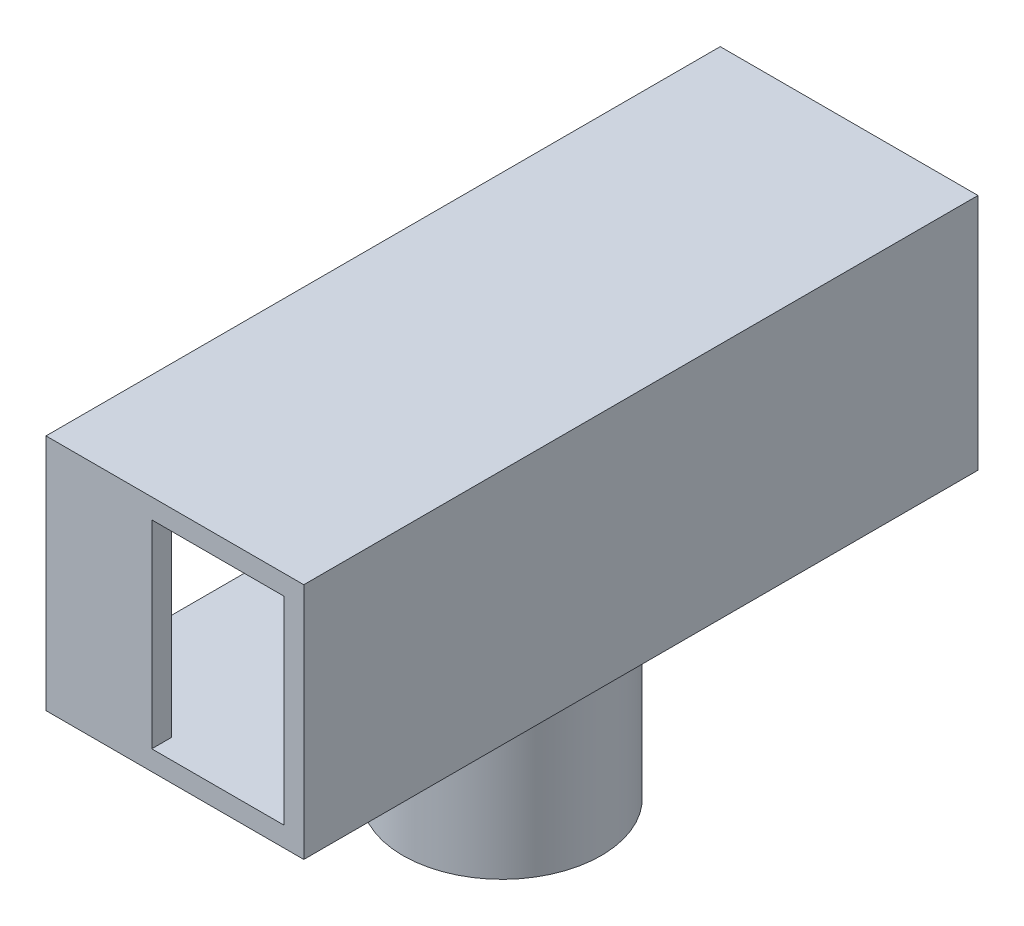
ISO-10303-21;
HEADER;
FILE_DESCRIPTION(('STEP AP214'),'2;1');
FILE_NAME('part.step','',(''),(''),'','','');
FILE_SCHEMA(('AUTOMOTIVE_DESIGN { 1 0 10303 214 1 1 1 1 }'));
ENDSEC;
DATA;
#1=APPLICATION_CONTEXT('core data for automotive mechanical design processes');
#2=APPLICATION_PROTOCOL_DEFINITION('international standard','automotive_design',2000,#1);
#3=PRODUCT_CONTEXT('',#1,'mechanical');
#4=PRODUCT('Part','Part','',(#3));
#5=PRODUCT_RELATED_PRODUCT_CATEGORY('part','',(#4));
#6=PRODUCT_DEFINITION_FORMATION('','',#4);
#7=PRODUCT_DEFINITION_CONTEXT('part definition',#1,'design');
#8=PRODUCT_DEFINITION('design','',#6,#7);
#9=PRODUCT_DEFINITION_SHAPE('','',#8);
#10=(LENGTH_UNIT() NAMED_UNIT(*) SI_UNIT(.MILLI.,.METRE.));
#11=(NAMED_UNIT(*) PLANE_ANGLE_UNIT() SI_UNIT($,.RADIAN.));
#12=(NAMED_UNIT(*) SI_UNIT($,.STERADIAN.) SOLID_ANGLE_UNIT());
#13=UNCERTAINTY_MEASURE_WITH_UNIT(LENGTH_MEASURE(1.E-05),#10,'distance_accuracy_value','');
#14=(GEOMETRIC_REPRESENTATION_CONTEXT(3) GLOBAL_UNCERTAINTY_ASSIGNED_CONTEXT((#13)) GLOBAL_UNIT_ASSIGNED_CONTEXT((#10,
#11,#12)) REPRESENTATION_CONTEXT('',''));
#15=CARTESIAN_POINT('',(0.,0.,0.));
#16=DIRECTION('',(0.,0.,1.));
#17=DIRECTION('',(1.,0.,0.));
#18=AXIS2_PLACEMENT_3D('',#15,#16,#17);
#19=CARTESIAN_POINT('',(-9.00000000000001,30.5,-24.));
#20=DIRECTION('',(1.,0.,0.));
#21=DIRECTION('',(0.,0.,-1.));
#22=AXIS2_PLACEMENT_3D('',#19,#20,#21);
#23=PLANE('',#22);
#24=DIRECTION('',(0.,0.,1.));
#25=VECTOR('',#24,1.);
#26=CARTESIAN_POINT('',(-9.00000000000001,14.,-24.));
#27=LINE('',#26,#25);
#28=CARTESIAN_POINT('',(-9.00000000000001,14.,-25.5));
#29=VERTEX_POINT('',#28);
#30=CARTESIAN_POINT('',(-9.,14.,25.5));
#31=VERTEX_POINT('',#30);
#32=EDGE_CURVE('E175',#29,#31,#27,.T.);
#33=ORIENTED_EDGE('',*,*,#32,.T.);
#34=DIRECTION('',(0.,-1.,0.));
#35=VECTOR('',#34,1.);
#36=CARTESIAN_POINT('',(-9.,30.5,25.5));
#37=LINE('',#36,#35);
#38=CARTESIAN_POINT('',(-9.,32.,25.5));
#39=VERTEX_POINT('',#38);
#40=EDGE_CURVE('E185',#39,#31,#37,.T.);
#41=ORIENTED_EDGE('',*,*,#40,.F.);
#42=DIRECTION('',(0.,0.,1.));
#43=VECTOR('',#42,1.);
#44=CARTESIAN_POINT('',(-9.00000000000001,32.,-24.));
#45=LINE('',#44,#43);
#46=CARTESIAN_POINT('',(-9.00000000000001,32.,-25.5));
#47=VERTEX_POINT('',#46);
#48=EDGE_CURVE('E188',#47,#39,#45,.T.);
#49=ORIENTED_EDGE('',*,*,#48,.F.);
#50=DIRECTION('',(0.,-1.,0.));
#51=VECTOR('',#50,1.);
#52=CARTESIAN_POINT('',(-9.00000000000001,30.5,-25.5));
#53=LINE('',#52,#51);
#54=EDGE_CURVE('E45',#47,#29,#53,.T.);
#55=ORIENTED_EDGE('',*,*,#54,.T.);
#56=EDGE_LOOP('',(#33,#41,#49,#55));
#57=FACE_BOUND('',#56,.T.);
#58=DIRECTION('',(0.,0.,1.));
#59=VECTOR('',#58,1.);
#60=CARTESIAN_POINT('',(-9.00000000000001,15.5,-24.));
#61=LINE('',#60,#59);
#62=CARTESIAN_POINT('',(-9.00000000000001,15.5,-24.));
#63=VERTEX_POINT('',#62);
#64=CARTESIAN_POINT('',(-9.,15.5,24.));
#65=VERTEX_POINT('',#64);
#66=EDGE_CURVE('E141',#63,#65,#61,.T.);
#67=ORIENTED_EDGE('',*,*,#66,.F.);
#68=DIRECTION('',(0.,-1.,0.));
#69=VECTOR('',#68,1.);
#70=CARTESIAN_POINT('',(-9.00000000000001,30.5,-24.));
#71=LINE('',#70,#69);
#72=CARTESIAN_POINT('',(-9.00000000000001,30.5,-24.));
#73=VERTEX_POINT('',#72);
#74=EDGE_CURVE('E153',#73,#63,#71,.T.);
#75=ORIENTED_EDGE('',*,*,#74,.F.);
#76=DIRECTION('',(0.,0.,1.));
#77=VECTOR('',#76,1.);
#78=CARTESIAN_POINT('',(-9.00000000000001,30.5,-24.));
#79=LINE('',#78,#77);
#80=CARTESIAN_POINT('',(-9.,30.5,24.));
#81=VERTEX_POINT('',#80);
#82=EDGE_CURVE('E66',#73,#81,#79,.T.);
#83=ORIENTED_EDGE('',*,*,#82,.T.);
#84=DIRECTION('',(0.,-1.,0.));
#85=VECTOR('',#84,1.);
#86=CARTESIAN_POINT('',(-9.,30.5,24.));
#87=LINE('',#86,#85);
#88=EDGE_CURVE('E151',#81,#65,#87,.T.);
#89=ORIENTED_EDGE('',*,*,#88,.T.);
#90=EDGE_LOOP('',(#67,#75,#83,#89));
#91=FACE_BOUND('',#90,.T.);
#92=ADVANCED_FACE('F41',(#57,#91),#23,.F.);
#93=CARTESIAN_POINT('',(0.,1.5,0.));
#94=DIRECTION('',(0.,-1.,0.));
#95=DIRECTION('',(0.,0.,-1.));
#96=AXIS2_PLACEMENT_3D('',#93,#94,#95);
#97=CYLINDRICAL_SURFACE('',#96,7.5);
#98=CARTESIAN_POINT('',(0.,0.,0.));
#99=DIRECTION('',(0.,1.,0.));
#100=DIRECTION('',(0.,0.,1.));
#101=AXIS2_PLACEMENT_3D('',#98,#99,#100);
#102=CIRCLE('',#101,7.5);
#103=CARTESIAN_POINT('',(0.,0.,7.5));
#104=VERTEX_POINT('',#103);
#105=EDGE_CURVE('E11',#104,#104,#102,.T.);
#106=ORIENTED_EDGE('',*,*,#105,.T.);
#107=EDGE_LOOP('',(#106));
#108=FACE_BOUND('',#107,.T.);
#109=CARTESIAN_POINT('',(0.,14.,0.));
#110=DIRECTION('',(0.,1.,0.));
#111=DIRECTION('',(0.,0.,1.));
#112=AXIS2_PLACEMENT_3D('',#109,#110,#111);
#113=CIRCLE('',#112,7.5);
#114=CARTESIAN_POINT('',(0.,14.,7.5));
#115=VERTEX_POINT('',#114);
#116=EDGE_CURVE('E50',#115,#115,#113,.T.);
#117=ORIENTED_EDGE('',*,*,#116,.F.);
#118=EDGE_LOOP('',(#117));
#119=FACE_BOUND('',#118,.T.);
#120=ADVANCED_FACE('F225',(#108,#119),#97,.T.);
#121=CARTESIAN_POINT('',(0.,0.,0.));
#122=DIRECTION('',(0.,1.,0.));
#123=DIRECTION('',(0.,0.,1.));
#124=AXIS2_PLACEMENT_3D('',#121,#122,#123);
#125=PLANE('',#124);
#126=CARTESIAN_POINT('',(0.,0.,0.));
#127=DIRECTION('',(0.,1.,0.));
#128=DIRECTION('',(0.,0.,1.));
#129=AXIS2_PLACEMENT_3D('',#126,#127,#128);
#130=CIRCLE('',#129,6.);
#131=CARTESIAN_POINT('',(0.,0.,6.));
#132=VERTEX_POINT('',#131);
#133=EDGE_CURVE('E162',#132,#132,#130,.T.);
#134=ORIENTED_EDGE('',*,*,#133,.T.);
#135=EDGE_LOOP('',(#134));
#136=FACE_BOUND('',#135,.T.);
#137=ORIENTED_EDGE('',*,*,#105,.F.);
#138=EDGE_LOOP('',(#137));
#139=FACE_BOUND('',#138,.T.);
#140=ADVANCED_FACE('F230',(#136,#139),#125,.F.);
#141=CARTESIAN_POINT('',(10.5,30.5,-24.));
#142=DIRECTION('',(-1.,0.,0.));
#143=DIRECTION('',(0.,0.,1.));
#144=AXIS2_PLACEMENT_3D('',#141,#142,#143);
#145=PLANE('',#144);
#146=DIRECTION('',(0.,0.,-1.));
#147=VECTOR('',#146,1.);
#148=CARTESIAN_POINT('',(10.5,14.,-24.));
#149=LINE('',#148,#147);
#150=CARTESIAN_POINT('',(10.5,14.,25.5));
#151=VERTEX_POINT('',#150);
#152=CARTESIAN_POINT('',(10.5,14.,-25.5));
#153=VERTEX_POINT('',#152);
#154=EDGE_CURVE('E165',#151,#153,#149,.T.);
#155=ORIENTED_EDGE('',*,*,#154,.T.);
#156=DIRECTION('',(0.,-1.,0.));
#157=VECTOR('',#156,1.);
#158=CARTESIAN_POINT('',(10.5,30.5,-25.5));
#159=LINE('',#158,#157);
#160=CARTESIAN_POINT('',(10.5,32.,-25.5));
#161=VERTEX_POINT('',#160);
#162=EDGE_CURVE('E168',#161,#153,#159,.T.);
#163=ORIENTED_EDGE('',*,*,#162,.F.);
#164=DIRECTION('',(0.,0.,-1.));
#165=VECTOR('',#164,1.);
#166=CARTESIAN_POINT('',(10.5,32.,-24.));
#167=LINE('',#166,#165);
#168=CARTESIAN_POINT('',(10.5,32.,25.5));
#169=VERTEX_POINT('',#168);
#170=EDGE_CURVE('E174',#169,#161,#167,.T.);
#171=ORIENTED_EDGE('',*,*,#170,.F.);
#172=DIRECTION('',(0.,-1.,0.));
#173=VECTOR('',#172,1.);
#174=CARTESIAN_POINT('',(10.5,30.5,25.5));
#175=LINE('',#174,#173);
#176=EDGE_CURVE('E182',#169,#151,#175,.T.);
#177=ORIENTED_EDGE('',*,*,#176,.T.);
#178=EDGE_LOOP('',(#155,#163,#171,#177));
#179=FACE_BOUND('',#178,.T.);
#180=ADVANCED_FACE('F210',(#179),#145,.F.);
#181=CARTESIAN_POINT('',(-9.00000000000001,30.5,-25.5));
#182=DIRECTION('',(0.,0.,1.));
#183=DIRECTION('',(1.,0.,0.));
#184=AXIS2_PLACEMENT_3D('',#181,#182,#183);
#185=PLANE('',#184);
#186=DIRECTION('',(-1.,0.,0.));
#187=VECTOR('',#186,1.);
#188=CARTESIAN_POINT('',(-9.00000000000001,14.,-25.5));
#189=LINE('',#188,#187);
#190=EDGE_CURVE('E171',#153,#29,#189,.T.);
#191=ORIENTED_EDGE('',*,*,#190,.T.);
#192=ORIENTED_EDGE('',*,*,#54,.F.);
#193=DIRECTION('',(-1.,0.,0.));
#194=VECTOR('',#193,1.);
#195=CARTESIAN_POINT('',(-9.00000000000001,32.,-25.5));
#196=LINE('',#195,#194);
#197=EDGE_CURVE('E181',#161,#47,#196,.T.);
#198=ORIENTED_EDGE('',*,*,#197,.F.);
#199=ORIENTED_EDGE('',*,*,#162,.T.);
#200=EDGE_LOOP('',(#191,#192,#198,#199));
#201=FACE_BOUND('',#200,.T.);
#202=ADVANCED_FACE('F212',(#201),#185,.F.);
#203=CARTESIAN_POINT('',(-9.,30.5,25.5));
#204=DIRECTION('',(0.,0.,-1.));
#205=DIRECTION('',(-1.,0.,0.));
#206=AXIS2_PLACEMENT_3D('',#203,#204,#205);
#207=PLANE('',#206);
#208=DIRECTION('',(0.,-1.,0.));
#209=VECTOR('',#208,1.);
#210=CARTESIAN_POINT('',(9.,30.5,25.5));
#211=LINE('',#210,#209);
#212=CARTESIAN_POINT('',(9.,30.5,25.5));
#213=VERTEX_POINT('',#212);
#214=CARTESIAN_POINT('',(9.,15.5,25.5));
#215=VERTEX_POINT('',#214);
#216=EDGE_CURVE('E249',#213,#215,#211,.T.);
#217=ORIENTED_EDGE('',*,*,#216,.T.);
#218=DIRECTION('',(-1.,0.,0.));
#219=VECTOR('',#218,1.);
#220=CARTESIAN_POINT('',(-9.,15.5,25.5));
#221=LINE('',#220,#219);
#222=CARTESIAN_POINT('',(-1.,15.5,25.5));
#223=VERTEX_POINT('',#222);
#224=EDGE_CURVE('E250',#215,#223,#221,.T.);
#225=ORIENTED_EDGE('',*,*,#224,.T.);
#226=DIRECTION('',(0.,1.,0.));
#227=VECTOR('',#226,1.);
#228=CARTESIAN_POINT('',(-0.999999999999999,30.5,25.5));
#229=LINE('',#228,#227);
#230=CARTESIAN_POINT('',(-0.999999999999999,30.5,25.5));
#231=VERTEX_POINT('',#230);
#232=EDGE_CURVE('E125',#223,#231,#229,.T.);
#233=ORIENTED_EDGE('',*,*,#232,.T.);
#234=DIRECTION('',(1.,0.,0.));
#235=VECTOR('',#234,1.);
#236=CARTESIAN_POINT('',(-9.,30.5,25.5));
#237=LINE('',#236,#235);
#238=EDGE_CURVE('E251',#231,#213,#237,.T.);
#239=ORIENTED_EDGE('',*,*,#238,.T.);
#240=EDGE_LOOP('',(#217,#225,#233,#239));
#241=FACE_BOUND('',#240,.T.);
#242=DIRECTION('',(1.,0.,0.));
#243=VECTOR('',#242,1.);
#244=CARTESIAN_POINT('',(-9.,14.,25.5));
#245=LINE('',#244,#243);
#246=EDGE_CURVE('E172',#31,#151,#245,.T.);
#247=ORIENTED_EDGE('',*,*,#246,.T.);
#248=ORIENTED_EDGE('',*,*,#176,.F.);
#249=DIRECTION('',(1.,0.,0.));
#250=VECTOR('',#249,1.);
#251=CARTESIAN_POINT('',(-9.,32.,25.5));
#252=LINE('',#251,#250);
#253=EDGE_CURVE('E186',#39,#169,#252,.T.);
#254=ORIENTED_EDGE('',*,*,#253,.F.);
#255=ORIENTED_EDGE('',*,*,#40,.T.);
#256=EDGE_LOOP('',(#247,#248,#254,#255));
#257=FACE_BOUND('',#256,.T.);
#258=ADVANCED_FACE('F205',(#241,#257),#207,.F.);
#259=CARTESIAN_POINT('',(0.,32.,0.));
#260=DIRECTION('',(0.,1.,0.));
#261=DIRECTION('',(0.,0.,1.));
#262=AXIS2_PLACEMENT_3D('',#259,#260,#261);
#263=PLANE('',#262);
#264=ORIENTED_EDGE('',*,*,#170,.T.);
#265=ORIENTED_EDGE('',*,*,#197,.T.);
#266=ORIENTED_EDGE('',*,*,#48,.T.);
#267=ORIENTED_EDGE('',*,*,#253,.T.);
#268=EDGE_LOOP('',(#264,#265,#266,#267));
#269=FACE_BOUND('',#268,.T.);
#270=ADVANCED_FACE('F195',(#269),#263,.T.);
#271=CARTESIAN_POINT('',(0.,14.,0.));
#272=DIRECTION('',(0.,1.,0.));
#273=DIRECTION('',(0.,0.,1.));
#274=AXIS2_PLACEMENT_3D('',#271,#272,#273);
#275=PLANE('',#274);
#276=ORIENTED_EDGE('',*,*,#116,.T.);
#277=EDGE_LOOP('',(#276));
#278=FACE_BOUND('',#277,.T.);
#279=ORIENTED_EDGE('',*,*,#154,.F.);
#280=ORIENTED_EDGE('',*,*,#246,.F.);
#281=ORIENTED_EDGE('',*,*,#32,.F.);
#282=ORIENTED_EDGE('',*,*,#190,.F.);
#283=EDGE_LOOP('',(#279,#280,#281,#282));
#284=FACE_BOUND('',#283,.T.);
#285=ADVANCED_FACE('F43',(#278,#284),#275,.F.);
#286=CARTESIAN_POINT('',(0.,1.5,0.));
#287=DIRECTION('',(0.,-1.,0.));
#288=DIRECTION('',(0.,0.,-1.));
#289=AXIS2_PLACEMENT_3D('',#286,#287,#288);
#290=CYLINDRICAL_SURFACE('',#289,6.);
#291=ORIENTED_EDGE('',*,*,#133,.F.);
#292=EDGE_LOOP('',(#291));
#293=FACE_BOUND('',#292,.T.);
#294=CARTESIAN_POINT('',(0.,15.5,0.));
#295=DIRECTION('',(0.,1.,0.));
#296=DIRECTION('',(0.,0.,1.));
#297=AXIS2_PLACEMENT_3D('',#294,#295,#296);
#298=CIRCLE('',#297,6.);
#299=CARTESIAN_POINT('',(0.,15.5,6.));
#300=VERTEX_POINT('',#299);
#301=EDGE_CURVE('E159',#300,#300,#298,.T.);
#302=ORIENTED_EDGE('',*,*,#301,.T.);
#303=EDGE_LOOP('',(#302));
#304=FACE_BOUND('',#303,.T.);
#305=ADVANCED_FACE('F215',(#293,#304),#290,.F.);
#306=CARTESIAN_POINT('',(8.99999999999999,30.5,-24.));
#307=DIRECTION('',(-1.,0.,0.));
#308=DIRECTION('',(0.,0.,1.));
#309=AXIS2_PLACEMENT_3D('',#306,#307,#308);
#310=PLANE('',#309);
#311=DIRECTION('',(0.,0.,-1.));
#312=VECTOR('',#311,1.);
#313=CARTESIAN_POINT('',(8.99999999999999,15.5,-24.));
#314=LINE('',#313,#312);
#315=CARTESIAN_POINT('',(8.99999999999999,15.5,-24.));
#316=VERTEX_POINT('',#315);
#317=EDGE_CURVE('E254',#215,#316,#314,.T.);
#318=ORIENTED_EDGE('',*,*,#317,.F.);
#319=ORIENTED_EDGE('',*,*,#216,.F.);
#320=DIRECTION('',(0.,0.,-1.));
#321=VECTOR('',#320,1.);
#322=CARTESIAN_POINT('',(8.99999999999999,30.5,-24.));
#323=LINE('',#322,#321);
#324=CARTESIAN_POINT('',(8.99999999999999,30.5,-24.));
#325=VERTEX_POINT('',#324);
#326=EDGE_CURVE('E142',#213,#325,#323,.T.);
#327=ORIENTED_EDGE('',*,*,#326,.T.);
#328=DIRECTION('',(0.,-1.,0.));
#329=VECTOR('',#328,1.);
#330=CARTESIAN_POINT('',(8.99999999999999,30.5,-24.));
#331=LINE('',#330,#329);
#332=EDGE_CURVE('E156',#325,#316,#331,.T.);
#333=ORIENTED_EDGE('',*,*,#332,.T.);
#334=EDGE_LOOP('',(#318,#319,#327,#333));
#335=FACE_BOUND('',#334,.T.);
#336=ADVANCED_FACE('F221',(#335),#310,.T.);
#337=CARTESIAN_POINT('',(-9.00000000000001,30.5,-24.));
#338=DIRECTION('',(0.,0.,1.));
#339=DIRECTION('',(1.,0.,0.));
#340=AXIS2_PLACEMENT_3D('',#337,#338,#339);
#341=PLANE('',#340);
#342=DIRECTION('',(-1.,0.,0.));
#343=VECTOR('',#342,1.);
#344=CARTESIAN_POINT('',(-9.00000000000001,15.5,-24.));
#345=LINE('',#344,#343);
#346=EDGE_CURVE('E147',#316,#63,#345,.T.);
#347=ORIENTED_EDGE('',*,*,#346,.F.);
#348=ORIENTED_EDGE('',*,*,#332,.F.);
#349=DIRECTION('',(-1.,0.,0.));
#350=VECTOR('',#349,1.);
#351=CARTESIAN_POINT('',(-9.00000000000001,30.5,-24.));
#352=LINE('',#351,#350);
#353=EDGE_CURVE('E145',#325,#73,#352,.T.);
#354=ORIENTED_EDGE('',*,*,#353,.T.);
#355=ORIENTED_EDGE('',*,*,#74,.T.);
#356=EDGE_LOOP('',(#347,#348,#354,#355));
#357=FACE_BOUND('',#356,.T.);
#358=ADVANCED_FACE('F265',(#357),#341,.T.);
#359=CARTESIAN_POINT('',(-9.,30.5,24.));
#360=DIRECTION('',(0.,0.,-1.));
#361=DIRECTION('',(-1.,0.,0.));
#362=AXIS2_PLACEMENT_3D('',#359,#360,#361);
#363=PLANE('',#362);
#364=DIRECTION('',(0.,1.,0.));
#365=VECTOR('',#364,1.);
#366=CARTESIAN_POINT('',(-0.999999999999999,30.5,24.));
#367=LINE('',#366,#365);
#368=CARTESIAN_POINT('',(-1.,15.5,24.));
#369=VERTEX_POINT('',#368);
#370=CARTESIAN_POINT('',(-0.999999999999999,30.5,24.));
#371=VERTEX_POINT('',#370);
#372=EDGE_CURVE('E122',#369,#371,#367,.T.);
#373=ORIENTED_EDGE('',*,*,#372,.F.);
#374=DIRECTION('',(1.,0.,0.));
#375=VECTOR('',#374,1.);
#376=CARTESIAN_POINT('',(-9.,15.5,24.));
#377=LINE('',#376,#375);
#378=EDGE_CURVE('E134',#65,#369,#377,.T.);
#379=ORIENTED_EDGE('',*,*,#378,.F.);
#380=ORIENTED_EDGE('',*,*,#88,.F.);
#381=DIRECTION('',(1.,0.,0.));
#382=VECTOR('',#381,1.);
#383=CARTESIAN_POINT('',(-9.,30.5,24.));
#384=LINE('',#383,#382);
#385=EDGE_CURVE('E136',#81,#371,#384,.T.);
#386=ORIENTED_EDGE('',*,*,#385,.T.);
#387=EDGE_LOOP('',(#373,#379,#380,#386));
#388=FACE_BOUND('',#387,.T.);
#389=ADVANCED_FACE('F133',(#388),#363,.T.);
#390=CARTESIAN_POINT('',(0.,30.5,0.));
#391=DIRECTION('',(0.,1.,0.));
#392=DIRECTION('',(0.,0.,1.));
#393=AXIS2_PLACEMENT_3D('',#390,#391,#392);
#394=PLANE('',#393);
#395=ORIENTED_EDGE('',*,*,#326,.F.);
#396=ORIENTED_EDGE('',*,*,#238,.F.);
#397=DIRECTION('',(0.,0.,-1.));
#398=VECTOR('',#397,1.);
#399=CARTESIAN_POINT('',(-0.999999999999999,30.5,39.));
#400=LINE('',#399,#398);
#401=EDGE_CURVE('E58',#231,#371,#400,.T.);
#402=ORIENTED_EDGE('',*,*,#401,.T.);
#403=ORIENTED_EDGE('',*,*,#385,.F.);
#404=ORIENTED_EDGE('',*,*,#82,.F.);
#405=ORIENTED_EDGE('',*,*,#353,.F.);
#406=EDGE_LOOP('',(#395,#396,#402,#403,#404,#405));
#407=FACE_BOUND('',#406,.T.);
#408=ADVANCED_FACE('F266',(#407),#394,.F.);
#409=CARTESIAN_POINT('',(0.,15.5,0.));
#410=DIRECTION('',(0.,1.,0.));
#411=DIRECTION('',(0.,0.,1.));
#412=AXIS2_PLACEMENT_3D('',#409,#410,#411);
#413=PLANE('',#412);
#414=ORIENTED_EDGE('',*,*,#301,.F.);
#415=EDGE_LOOP('',(#414));
#416=FACE_BOUND('',#415,.T.);
#417=ORIENTED_EDGE('',*,*,#317,.T.);
#418=ORIENTED_EDGE('',*,*,#346,.T.);
#419=ORIENTED_EDGE('',*,*,#66,.T.);
#420=ORIENTED_EDGE('',*,*,#378,.T.);
#421=DIRECTION('',(0.,0.,-1.));
#422=VECTOR('',#421,1.);
#423=CARTESIAN_POINT('',(-1.,15.5,39.));
#424=LINE('',#423,#422);
#425=EDGE_CURVE('E119',#223,#369,#424,.T.);
#426=ORIENTED_EDGE('',*,*,#425,.F.);
#427=ORIENTED_EDGE('',*,*,#224,.F.);
#428=EDGE_LOOP('',(#417,#418,#419,#420,#426,#427));
#429=FACE_BOUND('',#428,.T.);
#430=ADVANCED_FACE('F139',(#416,#429),#413,.T.);
#431=CARTESIAN_POINT('',(-0.999999999999999,30.5,39.));
#432=DIRECTION('',(-1.,0.,0.));
#433=DIRECTION('',(0.,-1.,0.));
#434=AXIS2_PLACEMENT_3D('',#431,#432,#433);
#435=PLANE('',#434);
#436=ORIENTED_EDGE('',*,*,#425,.T.);
#437=ORIENTED_EDGE('',*,*,#372,.T.);
#438=ORIENTED_EDGE('',*,*,#401,.F.);
#439=ORIENTED_EDGE('',*,*,#232,.F.);
#440=EDGE_LOOP('',(#436,#437,#438,#439));
#441=FACE_BOUND('',#440,.T.);
#442=ADVANCED_FACE('F121',(#441),#435,.F.);
#443=CLOSED_SHELL('',(#92,#120,#140,#180,#202,#258,#270,#285,#305,#336,#358,#389,#408,#430,#442));
#444=MANIFOLD_SOLID_BREP('B2',#443);
#445=ADVANCED_BREP_SHAPE_REPRESENTATION('',(#18,#444),#14);
#446=SHAPE_DEFINITION_REPRESENTATION(#9,#445);
ENDSEC;
END-ISO-10303-21;
